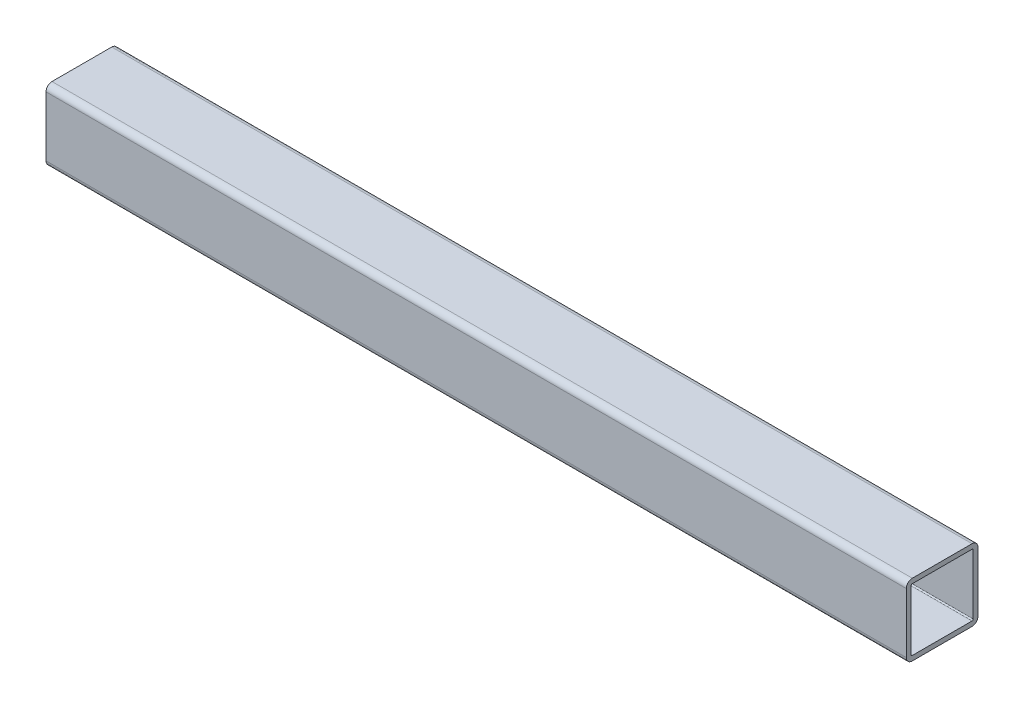
ISO-10303-21;
HEADER;
FILE_DESCRIPTION(('STEP AP214'),'2;1');
FILE_NAME('part.step','',(''),(''),'','','');
FILE_SCHEMA(('AUTOMOTIVE_DESIGN { 1 0 10303 214 1 1 1 1 }'));
ENDSEC;
DATA;
#1=APPLICATION_CONTEXT('core data for automotive mechanical design processes');
#2=APPLICATION_PROTOCOL_DEFINITION('international standard','automotive_design',2000,#1);
#3=PRODUCT_CONTEXT('',#1,'mechanical');
#4=PRODUCT('Part','Part','',(#3));
#5=PRODUCT_RELATED_PRODUCT_CATEGORY('part','',(#4));
#6=PRODUCT_DEFINITION_FORMATION('','',#4);
#7=PRODUCT_DEFINITION_CONTEXT('part definition',#1,'design');
#8=PRODUCT_DEFINITION('design','',#6,#7);
#9=PRODUCT_DEFINITION_SHAPE('','',#8);
#10=(LENGTH_UNIT() NAMED_UNIT(*) SI_UNIT(.MILLI.,.METRE.));
#11=(NAMED_UNIT(*) PLANE_ANGLE_UNIT() SI_UNIT($,.RADIAN.));
#12=(NAMED_UNIT(*) SI_UNIT($,.STERADIAN.) SOLID_ANGLE_UNIT());
#13=UNCERTAINTY_MEASURE_WITH_UNIT(LENGTH_MEASURE(1.E-05),#10,'distance_accuracy_value','');
#14=(GEOMETRIC_REPRESENTATION_CONTEXT(3) GLOBAL_UNCERTAINTY_ASSIGNED_CONTEXT((#13)) GLOBAL_UNIT_ASSIGNED_CONTEXT((#10,
#11,#12)) REPRESENTATION_CONTEXT('',''));
#15=CARTESIAN_POINT('',(0.,0.,0.));
#16=DIRECTION('',(0.,0.,1.));
#17=DIRECTION('',(1.,0.,0.));
#18=AXIS2_PLACEMENT_3D('',#15,#16,#17);
#19=CARTESIAN_POINT('',(228.6,-15.875,15.875));
#20=DIRECTION('',(1.,0.,0.));
#21=DIRECTION('',(0.,0.,-1.));
#22=AXIS2_PLACEMENT_3D('',#19,#20,#21);
#23=PLANE('',#22);
#24=CARTESIAN_POINT('',(228.6,-15.875,15.875));
#25=DIRECTION('',(1.,0.,0.));
#26=DIRECTION('',(0.,0.,-1.));
#27=AXIS2_PLACEMENT_3D('',#24,#25,#26);
#28=CIRCLE('',#27,3.175);
#29=CARTESIAN_POINT('',(228.6,-15.875,19.05));
#30=VERTEX_POINT('',#29);
#31=CARTESIAN_POINT('',(228.6,-19.05,15.875));
#32=VERTEX_POINT('',#31);
#33=EDGE_CURVE('E258',#30,#32,#28,.T.);
#34=ORIENTED_EDGE('',*,*,#33,.T.);
#35=DIRECTION('',(0.,0.,-1.));
#36=VECTOR('',#35,1.);
#37=CARTESIAN_POINT('',(228.6,-19.05,15.875));
#38=LINE('',#37,#36);
#39=CARTESIAN_POINT('',(228.6,-19.05,-15.875));
#40=VERTEX_POINT('',#39);
#41=EDGE_CURVE('E261',#32,#40,#38,.T.);
#42=ORIENTED_EDGE('',*,*,#41,.T.);
#43=CARTESIAN_POINT('',(228.6,-15.875,-15.875));
#44=DIRECTION('',(1.,0.,0.));
#45=DIRECTION('',(0.,0.,-1.));
#46=AXIS2_PLACEMENT_3D('',#43,#44,#45);
#47=CIRCLE('',#46,3.175);
#48=CARTESIAN_POINT('',(228.6,-15.875,-19.05));
#49=VERTEX_POINT('',#48);
#50=EDGE_CURVE('E264',#40,#49,#47,.T.);
#51=ORIENTED_EDGE('',*,*,#50,.T.);
#52=DIRECTION('',(0.,1.,0.));
#53=VECTOR('',#52,1.);
#54=CARTESIAN_POINT('',(228.6,15.875,-19.05));
#55=LINE('',#54,#53);
#56=CARTESIAN_POINT('',(228.6,15.875,-19.05));
#57=VERTEX_POINT('',#56);
#58=EDGE_CURVE('E266',#49,#57,#55,.T.);
#59=ORIENTED_EDGE('',*,*,#58,.T.);
#60=CARTESIAN_POINT('',(228.6,15.875,-15.875));
#61=DIRECTION('',(1.,0.,0.));
#62=DIRECTION('',(0.,0.,-1.));
#63=AXIS2_PLACEMENT_3D('',#60,#61,#62);
#64=CIRCLE('',#63,3.175);
#65=CARTESIAN_POINT('',(228.6,19.05,-15.875));
#66=VERTEX_POINT('',#65);
#67=EDGE_CURVE('E268',#57,#66,#64,.T.);
#68=ORIENTED_EDGE('',*,*,#67,.T.);
#69=DIRECTION('',(0.,0.,1.));
#70=VECTOR('',#69,1.);
#71=CARTESIAN_POINT('',(228.6,19.05,15.875));
#72=LINE('',#71,#70);
#73=CARTESIAN_POINT('',(228.6,19.05,15.875));
#74=VERTEX_POINT('',#73);
#75=EDGE_CURVE('E270',#66,#74,#72,.T.);
#76=ORIENTED_EDGE('',*,*,#75,.T.);
#77=CARTESIAN_POINT('',(228.6,15.875,15.875));
#78=DIRECTION('',(1.,0.,0.));
#79=DIRECTION('',(0.,0.,-1.));
#80=AXIS2_PLACEMENT_3D('',#77,#78,#79);
#81=CIRCLE('',#80,3.175);
#82=CARTESIAN_POINT('',(228.6,15.875,19.05));
#83=VERTEX_POINT('',#82);
#84=EDGE_CURVE('E272',#74,#83,#81,.T.);
#85=ORIENTED_EDGE('',*,*,#84,.T.);
#86=DIRECTION('',(0.,-1.,0.));
#87=VECTOR('',#86,1.);
#88=CARTESIAN_POINT('',(228.6,15.875,19.05));
#89=LINE('',#88,#87);
#90=EDGE_CURVE('E274',#83,#30,#89,.T.);
#91=ORIENTED_EDGE('',*,*,#90,.T.);
#92=EDGE_LOOP('',(#34,#42,#51,#59,#68,#76,#85,#91));
#93=FACE_BOUND('',#92,.T.);
#94=DIRECTION('',(0.,0.,-1.));
#95=VECTOR('',#94,1.);
#96=CARTESIAN_POINT('',(228.6,-16.51,15.875));
#97=LINE('',#96,#95);
#98=CARTESIAN_POINT('',(228.6,-16.51,15.875));
#99=VERTEX_POINT('',#98);
#100=CARTESIAN_POINT('',(228.6,-16.51,-15.875));
#101=VERTEX_POINT('',#100);
#102=EDGE_CURVE('E201',#99,#101,#97,.T.);
#103=ORIENTED_EDGE('',*,*,#102,.F.);
#104=CARTESIAN_POINT('',(228.6,-15.875,15.875));
#105=DIRECTION('',(1.,0.,0.));
#106=DIRECTION('',(0.,0.,-1.));
#107=AXIS2_PLACEMENT_3D('',#104,#105,#106);
#108=CIRCLE('',#107,0.635000000000002);
#109=CARTESIAN_POINT('',(228.6,-15.875,16.51));
#110=VERTEX_POINT('',#109);
#111=EDGE_CURVE('E193',#110,#99,#108,.T.);
#112=ORIENTED_EDGE('',*,*,#111,.F.);
#113=DIRECTION('',(0.,-1.,0.));
#114=VECTOR('',#113,1.);
#115=CARTESIAN_POINT('',(228.6,15.875,16.51));
#116=LINE('',#115,#114);
#117=CARTESIAN_POINT('',(228.6,15.875,16.51));
#118=VERTEX_POINT('',#117);
#119=EDGE_CURVE('E226',#118,#110,#116,.T.);
#120=ORIENTED_EDGE('',*,*,#119,.F.);
#121=CARTESIAN_POINT('',(228.6,15.875,15.875));
#122=DIRECTION('',(1.,0.,0.));
#123=DIRECTION('',(0.,0.,-1.));
#124=AXIS2_PLACEMENT_3D('',#121,#122,#123);
#125=CIRCLE('',#124,0.635000000000004);
#126=CARTESIAN_POINT('',(228.6,16.51,15.875));
#127=VERTEX_POINT('',#126);
#128=EDGE_CURVE('E224',#127,#118,#125,.T.);
#129=ORIENTED_EDGE('',*,*,#128,.F.);
#130=DIRECTION('',(0.,0.,1.));
#131=VECTOR('',#130,1.);
#132=CARTESIAN_POINT('',(228.6,16.51,15.875));
#133=LINE('',#132,#131);
#134=CARTESIAN_POINT('',(228.6,16.51,-15.875));
#135=VERTEX_POINT('',#134);
#136=EDGE_CURVE('E222',#135,#127,#133,.T.);
#137=ORIENTED_EDGE('',*,*,#136,.F.);
#138=CARTESIAN_POINT('',(228.6,15.875,-15.875));
#139=DIRECTION('',(1.,0.,0.));
#140=DIRECTION('',(0.,0.,-1.));
#141=AXIS2_PLACEMENT_3D('',#138,#139,#140);
#142=CIRCLE('',#141,0.635000000000004);
#143=CARTESIAN_POINT('',(228.6,15.875,-16.51));
#144=VERTEX_POINT('',#143);
#145=EDGE_CURVE('E220',#144,#135,#142,.T.);
#146=ORIENTED_EDGE('',*,*,#145,.F.);
#147=DIRECTION('',(0.,1.,0.));
#148=VECTOR('',#147,1.);
#149=CARTESIAN_POINT('',(228.6,15.875,-16.51));
#150=LINE('',#149,#148);
#151=CARTESIAN_POINT('',(228.6,-15.875,-16.51));
#152=VERTEX_POINT('',#151);
#153=EDGE_CURVE('E216',#152,#144,#150,.T.);
#154=ORIENTED_EDGE('',*,*,#153,.F.);
#155=CARTESIAN_POINT('',(228.6,-15.875,-15.875));
#156=DIRECTION('',(1.,0.,0.));
#157=DIRECTION('',(0.,0.,-1.));
#158=AXIS2_PLACEMENT_3D('',#155,#156,#157);
#159=CIRCLE('',#158,0.634999999999999);
#160=EDGE_CURVE('E214',#101,#152,#159,.T.);
#161=ORIENTED_EDGE('',*,*,#160,.F.);
#162=EDGE_LOOP('',(#103,#112,#120,#129,#137,#146,#154,#161));
#163=FACE_BOUND('',#162,.T.);
#164=ADVANCED_FACE('F80',(#93,#163),#23,.T.);
#165=CARTESIAN_POINT('',(-228.6,-15.875,15.875));
#166=DIRECTION('',(1.,0.,0.));
#167=DIRECTION('',(0.,0.,-1.));
#168=AXIS2_PLACEMENT_3D('',#165,#166,#167);
#169=PLANE('',#168);
#170=CARTESIAN_POINT('',(-228.6,-15.875,15.875));
#171=DIRECTION('',(1.,0.,0.));
#172=DIRECTION('',(0.,0.,-1.));
#173=AXIS2_PLACEMENT_3D('',#170,#171,#172);
#174=CIRCLE('',#173,3.175);
#175=CARTESIAN_POINT('',(-228.6,-15.875,19.05));
#176=VERTEX_POINT('',#175);
#177=CARTESIAN_POINT('',(-228.6,-19.05,15.875));
#178=VERTEX_POINT('',#177);
#179=EDGE_CURVE('E209',#176,#178,#174,.T.);
#180=ORIENTED_EDGE('',*,*,#179,.F.);
#181=DIRECTION('',(0.,-1.,0.));
#182=VECTOR('',#181,1.);
#183=CARTESIAN_POINT('',(-228.6,15.875,19.05));
#184=LINE('',#183,#182);
#185=CARTESIAN_POINT('',(-228.6,15.875,19.05));
#186=VERTEX_POINT('',#185);
#187=EDGE_CURVE('E262',#186,#176,#184,.T.);
#188=ORIENTED_EDGE('',*,*,#187,.F.);
#189=CARTESIAN_POINT('',(-228.6,15.875,15.875));
#190=DIRECTION('',(1.,0.,0.));
#191=DIRECTION('',(0.,0.,-1.));
#192=AXIS2_PLACEMENT_3D('',#189,#190,#191);
#193=CIRCLE('',#192,3.175);
#194=CARTESIAN_POINT('',(-228.6,19.05,15.875));
#195=VERTEX_POINT('',#194);
#196=EDGE_CURVE('E289',#195,#186,#193,.T.);
#197=ORIENTED_EDGE('',*,*,#196,.F.);
#198=DIRECTION('',(0.,0.,1.));
#199=VECTOR('',#198,1.);
#200=CARTESIAN_POINT('',(-228.6,19.05,15.875));
#201=LINE('',#200,#199);
#202=CARTESIAN_POINT('',(-228.6,19.05,-15.875));
#203=VERTEX_POINT('',#202);
#204=EDGE_CURVE('E287',#203,#195,#201,.T.);
#205=ORIENTED_EDGE('',*,*,#204,.F.);
#206=CARTESIAN_POINT('',(-228.6,15.875,-15.875));
#207=DIRECTION('',(1.,0.,0.));
#208=DIRECTION('',(0.,0.,-1.));
#209=AXIS2_PLACEMENT_3D('',#206,#207,#208);
#210=CIRCLE('',#209,3.175);
#211=CARTESIAN_POINT('',(-228.6,15.875,-19.05));
#212=VERTEX_POINT('',#211);
#213=EDGE_CURVE('E285',#212,#203,#210,.T.);
#214=ORIENTED_EDGE('',*,*,#213,.F.);
#215=DIRECTION('',(0.,1.,0.));
#216=VECTOR('',#215,1.);
#217=CARTESIAN_POINT('',(-228.6,15.875,-19.05));
#218=LINE('',#217,#216);
#219=CARTESIAN_POINT('',(-228.6,-15.875,-19.05));
#220=VERTEX_POINT('',#219);
#221=EDGE_CURVE('E283',#220,#212,#218,.T.);
#222=ORIENTED_EDGE('',*,*,#221,.F.);
#223=CARTESIAN_POINT('',(-228.6,-15.875,-15.875));
#224=DIRECTION('',(1.,0.,0.));
#225=DIRECTION('',(0.,0.,-1.));
#226=AXIS2_PLACEMENT_3D('',#223,#224,#225);
#227=CIRCLE('',#226,3.175);
#228=CARTESIAN_POINT('',(-228.6,-19.05,-15.875));
#229=VERTEX_POINT('',#228);
#230=EDGE_CURVE('E281',#229,#220,#227,.T.);
#231=ORIENTED_EDGE('',*,*,#230,.F.);
#232=DIRECTION('',(0.,0.,-1.));
#233=VECTOR('',#232,1.);
#234=CARTESIAN_POINT('',(-228.6,-19.05,15.875));
#235=LINE('',#234,#233);
#236=EDGE_CURVE('E279',#178,#229,#235,.T.);
#237=ORIENTED_EDGE('',*,*,#236,.F.);
#238=EDGE_LOOP('',(#180,#188,#197,#205,#214,#222,#231,#237));
#239=FACE_BOUND('',#238,.T.);
#240=CARTESIAN_POINT('',(-228.6,-15.875,15.875));
#241=DIRECTION('',(1.,0.,0.));
#242=DIRECTION('',(0.,0.,-1.));
#243=AXIS2_PLACEMENT_3D('',#240,#241,#242);
#244=CIRCLE('',#243,0.635000000000002);
#245=CARTESIAN_POINT('',(-228.6,-15.875,16.51));
#246=VERTEX_POINT('',#245);
#247=CARTESIAN_POINT('',(-228.6,-16.51,15.875));
#248=VERTEX_POINT('',#247);
#249=EDGE_CURVE('E103',#246,#248,#244,.T.);
#250=ORIENTED_EDGE('',*,*,#249,.T.);
#251=DIRECTION('',(0.,0.,-1.));
#252=VECTOR('',#251,1.);
#253=CARTESIAN_POINT('',(-228.6,-16.51,15.875));
#254=LINE('',#253,#252);
#255=CARTESIAN_POINT('',(-228.6,-16.51,-15.875));
#256=VERTEX_POINT('',#255);
#257=EDGE_CURVE('E208',#248,#256,#254,.T.);
#258=ORIENTED_EDGE('',*,*,#257,.T.);
#259=CARTESIAN_POINT('',(-228.6,-15.875,-15.875));
#260=DIRECTION('',(1.,0.,0.));
#261=DIRECTION('',(0.,0.,-1.));
#262=AXIS2_PLACEMENT_3D('',#259,#260,#261);
#263=CIRCLE('',#262,0.634999999999999);
#264=CARTESIAN_POINT('',(-228.6,-15.875,-16.51));
#265=VERTEX_POINT('',#264);
#266=EDGE_CURVE('E230',#256,#265,#263,.T.);
#267=ORIENTED_EDGE('',*,*,#266,.T.);
#268=DIRECTION('',(0.,1.,0.));
#269=VECTOR('',#268,1.);
#270=CARTESIAN_POINT('',(-228.6,15.875,-16.51));
#271=LINE('',#270,#269);
#272=CARTESIAN_POINT('',(-228.6,15.875,-16.51));
#273=VERTEX_POINT('',#272);
#274=EDGE_CURVE('E233',#265,#273,#271,.T.);
#275=ORIENTED_EDGE('',*,*,#274,.T.);
#276=CARTESIAN_POINT('',(-228.6,15.875,-15.875));
#277=DIRECTION('',(1.,0.,0.));
#278=DIRECTION('',(0.,0.,-1.));
#279=AXIS2_PLACEMENT_3D('',#276,#277,#278);
#280=CIRCLE('',#279,0.635000000000004);
#281=CARTESIAN_POINT('',(-228.6,16.51,-15.875));
#282=VERTEX_POINT('',#281);
#283=EDGE_CURVE('E236',#273,#282,#280,.T.);
#284=ORIENTED_EDGE('',*,*,#283,.T.);
#285=DIRECTION('',(0.,0.,1.));
#286=VECTOR('',#285,1.);
#287=CARTESIAN_POINT('',(-228.6,16.51,15.875));
#288=LINE('',#287,#286);
#289=CARTESIAN_POINT('',(-228.6,16.51,15.875));
#290=VERTEX_POINT('',#289);
#291=EDGE_CURVE('E239',#282,#290,#288,.T.);
#292=ORIENTED_EDGE('',*,*,#291,.T.);
#293=CARTESIAN_POINT('',(-228.6,15.875,15.875));
#294=DIRECTION('',(1.,0.,0.));
#295=DIRECTION('',(0.,0.,-1.));
#296=AXIS2_PLACEMENT_3D('',#293,#294,#295);
#297=CIRCLE('',#296,0.635000000000004);
#298=CARTESIAN_POINT('',(-228.6,15.875,16.51));
#299=VERTEX_POINT('',#298);
#300=EDGE_CURVE('E242',#290,#299,#297,.T.);
#301=ORIENTED_EDGE('',*,*,#300,.T.);
#302=DIRECTION('',(0.,-1.,0.));
#303=VECTOR('',#302,1.);
#304=CARTESIAN_POINT('',(-228.6,15.875,16.51));
#305=LINE('',#304,#303);
#306=EDGE_CURVE('E202',#299,#246,#305,.T.);
#307=ORIENTED_EDGE('',*,*,#306,.T.);
#308=EDGE_LOOP('',(#250,#258,#267,#275,#284,#292,#301,#307));
#309=FACE_BOUND('',#308,.T.);
#310=ADVANCED_FACE('F319',(#239,#309),#169,.F.);
#311=CARTESIAN_POINT('',(228.6,-15.875,15.875));
#312=DIRECTION('',(-1.,0.,0.));
#313=DIRECTION('',(0.,0.,1.));
#314=AXIS2_PLACEMENT_3D('',#311,#312,#313);
#315=CYLINDRICAL_SURFACE('',#314,3.175);
#316=ORIENTED_EDGE('',*,*,#179,.T.);
#317=DIRECTION('',(-1.,0.,0.));
#318=VECTOR('',#317,1.);
#319=CARTESIAN_POINT('',(228.6,-19.05,15.875));
#320=LINE('',#319,#318);
#321=EDGE_CURVE('E12',#32,#178,#320,.T.);
#322=ORIENTED_EDGE('',*,*,#321,.F.);
#323=ORIENTED_EDGE('',*,*,#33,.F.);
#324=DIRECTION('',(-1.,0.,0.));
#325=VECTOR('',#324,1.);
#326=CARTESIAN_POINT('',(228.6,-15.875,19.05));
#327=LINE('',#326,#325);
#328=EDGE_CURVE('E276',#30,#176,#327,.T.);
#329=ORIENTED_EDGE('',*,*,#328,.T.);
#330=EDGE_LOOP('',(#316,#322,#323,#329));
#331=FACE_BOUND('',#330,.T.);
#332=ADVANCED_FACE('F82',(#331),#315,.T.);
#333=CARTESIAN_POINT('',(228.6,-19.05,15.875));
#334=DIRECTION('',(0.,1.,0.));
#335=DIRECTION('',(0.,0.,1.));
#336=AXIS2_PLACEMENT_3D('',#333,#334,#335);
#337=PLANE('',#336);
#338=ORIENTED_EDGE('',*,*,#236,.T.);
#339=DIRECTION('',(-1.,0.,0.));
#340=VECTOR('',#339,1.);
#341=CARTESIAN_POINT('',(228.6,-19.05,-15.875));
#342=LINE('',#341,#340);
#343=EDGE_CURVE('E88',#40,#229,#342,.T.);
#344=ORIENTED_EDGE('',*,*,#343,.F.);
#345=ORIENTED_EDGE('',*,*,#41,.F.);
#346=ORIENTED_EDGE('',*,*,#321,.T.);
#347=EDGE_LOOP('',(#338,#344,#345,#346));
#348=FACE_BOUND('',#347,.T.);
#349=ADVANCED_FACE('F336',(#348),#337,.F.);
#350=CARTESIAN_POINT('',(228.6,-15.875,-15.875));
#351=DIRECTION('',(-1.,0.,0.));
#352=DIRECTION('',(0.,0.,1.));
#353=AXIS2_PLACEMENT_3D('',#350,#351,#352);
#354=CYLINDRICAL_SURFACE('',#353,3.175);
#355=ORIENTED_EDGE('',*,*,#230,.T.);
#356=DIRECTION('',(-1.,0.,0.));
#357=VECTOR('',#356,1.);
#358=CARTESIAN_POINT('',(228.6,-15.875,-19.05));
#359=LINE('',#358,#357);
#360=EDGE_CURVE('E306',#49,#220,#359,.T.);
#361=ORIENTED_EDGE('',*,*,#360,.F.);
#362=ORIENTED_EDGE('',*,*,#50,.F.);
#363=ORIENTED_EDGE('',*,*,#343,.T.);
#364=EDGE_LOOP('',(#355,#361,#362,#363));
#365=FACE_BOUND('',#364,.T.);
#366=ADVANCED_FACE('F313',(#365),#354,.T.);
#367=CARTESIAN_POINT('',(228.6,15.875,-19.05));
#368=DIRECTION('',(0.,0.,1.));
#369=DIRECTION('',(0.,-1.,0.));
#370=AXIS2_PLACEMENT_3D('',#367,#368,#369);
#371=PLANE('',#370);
#372=ORIENTED_EDGE('',*,*,#221,.T.);
#373=DIRECTION('',(-1.,0.,0.));
#374=VECTOR('',#373,1.);
#375=CARTESIAN_POINT('',(228.6,15.875,-19.05));
#376=LINE('',#375,#374);
#377=EDGE_CURVE('E303',#57,#212,#376,.T.);
#378=ORIENTED_EDGE('',*,*,#377,.F.);
#379=ORIENTED_EDGE('',*,*,#58,.F.);
#380=ORIENTED_EDGE('',*,*,#360,.T.);
#381=EDGE_LOOP('',(#372,#378,#379,#380));
#382=FACE_BOUND('',#381,.T.);
#383=ADVANCED_FACE('F325',(#382),#371,.F.);
#384=CARTESIAN_POINT('',(228.6,15.875,-15.875));
#385=DIRECTION('',(-1.,0.,0.));
#386=DIRECTION('',(0.,0.,1.));
#387=AXIS2_PLACEMENT_3D('',#384,#385,#386);
#388=CYLINDRICAL_SURFACE('',#387,3.175);
#389=ORIENTED_EDGE('',*,*,#213,.T.);
#390=DIRECTION('',(-1.,0.,0.));
#391=VECTOR('',#390,1.);
#392=CARTESIAN_POINT('',(228.6,19.05,-15.875));
#393=LINE('',#392,#391);
#394=EDGE_CURVE('E300',#66,#203,#393,.T.);
#395=ORIENTED_EDGE('',*,*,#394,.F.);
#396=ORIENTED_EDGE('',*,*,#67,.F.);
#397=ORIENTED_EDGE('',*,*,#377,.T.);
#398=EDGE_LOOP('',(#389,#395,#396,#397));
#399=FACE_BOUND('',#398,.T.);
#400=ADVANCED_FACE('F329',(#399),#388,.T.);
#401=CARTESIAN_POINT('',(228.6,19.05,15.875));
#402=DIRECTION('',(0.,-1.,0.));
#403=DIRECTION('',(0.,0.,-1.));
#404=AXIS2_PLACEMENT_3D('',#401,#402,#403);
#405=PLANE('',#404);
#406=ORIENTED_EDGE('',*,*,#204,.T.);
#407=DIRECTION('',(-1.,0.,0.));
#408=VECTOR('',#407,1.);
#409=CARTESIAN_POINT('',(228.6,19.05,15.875));
#410=LINE('',#409,#408);
#411=EDGE_CURVE('E297',#74,#195,#410,.T.);
#412=ORIENTED_EDGE('',*,*,#411,.F.);
#413=ORIENTED_EDGE('',*,*,#75,.F.);
#414=ORIENTED_EDGE('',*,*,#394,.T.);
#415=EDGE_LOOP('',(#406,#412,#413,#414));
#416=FACE_BOUND('',#415,.T.);
#417=ADVANCED_FACE('F349',(#416),#405,.F.);
#418=CARTESIAN_POINT('',(228.6,15.875,15.875));
#419=DIRECTION('',(-1.,0.,0.));
#420=DIRECTION('',(0.,0.,1.));
#421=AXIS2_PLACEMENT_3D('',#418,#419,#420);
#422=CYLINDRICAL_SURFACE('',#421,3.175);
#423=ORIENTED_EDGE('',*,*,#196,.T.);
#424=DIRECTION('',(-1.,0.,0.));
#425=VECTOR('',#424,1.);
#426=CARTESIAN_POINT('',(228.6,15.875,19.05));
#427=LINE('',#426,#425);
#428=EDGE_CURVE('E294',#83,#186,#427,.T.);
#429=ORIENTED_EDGE('',*,*,#428,.F.);
#430=ORIENTED_EDGE('',*,*,#84,.F.);
#431=ORIENTED_EDGE('',*,*,#411,.T.);
#432=EDGE_LOOP('',(#423,#429,#430,#431));
#433=FACE_BOUND('',#432,.T.);
#434=ADVANCED_FACE('F347',(#433),#422,.T.);
#435=CARTESIAN_POINT('',(228.6,15.875,19.05));
#436=DIRECTION('',(0.,0.,-1.));
#437=DIRECTION('',(0.,1.,0.));
#438=AXIS2_PLACEMENT_3D('',#435,#436,#437);
#439=PLANE('',#438);
#440=ORIENTED_EDGE('',*,*,#187,.T.);
#441=ORIENTED_EDGE('',*,*,#328,.F.);
#442=ORIENTED_EDGE('',*,*,#90,.F.);
#443=ORIENTED_EDGE('',*,*,#428,.T.);
#444=EDGE_LOOP('',(#440,#441,#442,#443));
#445=FACE_BOUND('',#444,.T.);
#446=ADVANCED_FACE('F342',(#445),#439,.F.);
#447=CARTESIAN_POINT('',(228.6,-15.875,15.875));
#448=DIRECTION('',(-1.,0.,0.));
#449=DIRECTION('',(0.,0.,1.));
#450=AXIS2_PLACEMENT_3D('',#447,#448,#449);
#451=CYLINDRICAL_SURFACE('',#450,0.635000000000002);
#452=ORIENTED_EDGE('',*,*,#249,.F.);
#453=DIRECTION('',(-1.,0.,0.));
#454=VECTOR('',#453,1.);
#455=CARTESIAN_POINT('',(228.6,-15.875,16.51));
#456=LINE('',#455,#454);
#457=EDGE_CURVE('E197',#110,#246,#456,.T.);
#458=ORIENTED_EDGE('',*,*,#457,.F.);
#459=ORIENTED_EDGE('',*,*,#111,.T.);
#460=DIRECTION('',(-1.,0.,0.));
#461=VECTOR('',#460,1.);
#462=CARTESIAN_POINT('',(228.6,-16.51,15.875));
#463=LINE('',#462,#461);
#464=EDGE_CURVE('E196',#99,#248,#463,.T.);
#465=ORIENTED_EDGE('',*,*,#464,.T.);
#466=EDGE_LOOP('',(#452,#458,#459,#465));
#467=FACE_BOUND('',#466,.T.);
#468=ADVANCED_FACE('F195',(#467),#451,.F.);
#469=CARTESIAN_POINT('',(228.6,-16.51,15.875));
#470=DIRECTION('',(0.,1.,0.));
#471=DIRECTION('',(0.,0.,1.));
#472=AXIS2_PLACEMENT_3D('',#469,#470,#471);
#473=PLANE('',#472);
#474=ORIENTED_EDGE('',*,*,#257,.F.);
#475=ORIENTED_EDGE('',*,*,#464,.F.);
#476=ORIENTED_EDGE('',*,*,#102,.T.);
#477=DIRECTION('',(-1.,0.,0.));
#478=VECTOR('',#477,1.);
#479=CARTESIAN_POINT('',(228.6,-16.51,-15.875));
#480=LINE('',#479,#478);
#481=EDGE_CURVE('E210',#101,#256,#480,.T.);
#482=ORIENTED_EDGE('',*,*,#481,.T.);
#483=EDGE_LOOP('',(#474,#475,#476,#482));
#484=FACE_BOUND('',#483,.T.);
#485=ADVANCED_FACE('F205',(#484),#473,.T.);
#486=CARTESIAN_POINT('',(228.6,-15.875,-15.875));
#487=DIRECTION('',(-1.,0.,0.));
#488=DIRECTION('',(0.,0.,1.));
#489=AXIS2_PLACEMENT_3D('',#486,#487,#488);
#490=CYLINDRICAL_SURFACE('',#489,0.634999999999999);
#491=ORIENTED_EDGE('',*,*,#266,.F.);
#492=ORIENTED_EDGE('',*,*,#481,.F.);
#493=ORIENTED_EDGE('',*,*,#160,.T.);
#494=DIRECTION('',(-1.,0.,0.));
#495=VECTOR('',#494,1.);
#496=CARTESIAN_POINT('',(228.6,-15.875,-16.51));
#497=LINE('',#496,#495);
#498=EDGE_CURVE('E255',#152,#265,#497,.T.);
#499=ORIENTED_EDGE('',*,*,#498,.T.);
#500=EDGE_LOOP('',(#491,#492,#493,#499));
#501=FACE_BOUND('',#500,.T.);
#502=ADVANCED_FACE('F374',(#501),#490,.F.);
#503=CARTESIAN_POINT('',(228.6,15.875,-16.51));
#504=DIRECTION('',(0.,0.,1.));
#505=DIRECTION('',(0.,-1.,0.));
#506=AXIS2_PLACEMENT_3D('',#503,#504,#505);
#507=PLANE('',#506);
#508=ORIENTED_EDGE('',*,*,#274,.F.);
#509=ORIENTED_EDGE('',*,*,#498,.F.);
#510=ORIENTED_EDGE('',*,*,#153,.T.);
#511=DIRECTION('',(-1.,0.,0.));
#512=VECTOR('',#511,1.);
#513=CARTESIAN_POINT('',(228.6,15.875,-16.51));
#514=LINE('',#513,#512);
#515=EDGE_CURVE('E253',#144,#273,#514,.T.);
#516=ORIENTED_EDGE('',*,*,#515,.T.);
#517=EDGE_LOOP('',(#508,#509,#510,#516));
#518=FACE_BOUND('',#517,.T.);
#519=ADVANCED_FACE('F378',(#518),#507,.T.);
#520=CARTESIAN_POINT('',(228.6,15.875,-15.875));
#521=DIRECTION('',(-1.,0.,0.));
#522=DIRECTION('',(0.,0.,1.));
#523=AXIS2_PLACEMENT_3D('',#520,#521,#522);
#524=CYLINDRICAL_SURFACE('',#523,0.635000000000004);
#525=ORIENTED_EDGE('',*,*,#283,.F.);
#526=ORIENTED_EDGE('',*,*,#515,.F.);
#527=ORIENTED_EDGE('',*,*,#145,.T.);
#528=DIRECTION('',(-1.,0.,0.));
#529=VECTOR('',#528,1.);
#530=CARTESIAN_POINT('',(228.6,16.51,-15.875));
#531=LINE('',#530,#529);
#532=EDGE_CURVE('E251',#135,#282,#531,.T.);
#533=ORIENTED_EDGE('',*,*,#532,.T.);
#534=EDGE_LOOP('',(#525,#526,#527,#533));
#535=FACE_BOUND('',#534,.T.);
#536=ADVANCED_FACE('F384',(#535),#524,.F.);
#537=CARTESIAN_POINT('',(228.6,16.51,15.875));
#538=DIRECTION('',(0.,-1.,0.));
#539=DIRECTION('',(0.,0.,-1.));
#540=AXIS2_PLACEMENT_3D('',#537,#538,#539);
#541=PLANE('',#540);
#542=ORIENTED_EDGE('',*,*,#291,.F.);
#543=ORIENTED_EDGE('',*,*,#532,.F.);
#544=ORIENTED_EDGE('',*,*,#136,.T.);
#545=DIRECTION('',(-1.,0.,0.));
#546=VECTOR('',#545,1.);
#547=CARTESIAN_POINT('',(228.6,16.51,15.875));
#548=LINE('',#547,#546);
#549=EDGE_CURVE('E249',#127,#290,#548,.T.);
#550=ORIENTED_EDGE('',*,*,#549,.T.);
#551=EDGE_LOOP('',(#542,#543,#544,#550));
#552=FACE_BOUND('',#551,.T.);
#553=ADVANCED_FACE('F388',(#552),#541,.T.);
#554=CARTESIAN_POINT('',(228.6,15.875,15.875));
#555=DIRECTION('',(-1.,0.,0.));
#556=DIRECTION('',(0.,0.,1.));
#557=AXIS2_PLACEMENT_3D('',#554,#555,#556);
#558=CYLINDRICAL_SURFACE('',#557,0.635000000000004);
#559=ORIENTED_EDGE('',*,*,#300,.F.);
#560=ORIENTED_EDGE('',*,*,#549,.F.);
#561=ORIENTED_EDGE('',*,*,#128,.T.);
#562=DIRECTION('',(-1.,0.,0.));
#563=VECTOR('',#562,1.);
#564=CARTESIAN_POINT('',(228.6,15.875,16.51));
#565=LINE('',#564,#563);
#566=EDGE_CURVE('E95',#118,#299,#565,.T.);
#567=ORIENTED_EDGE('',*,*,#566,.T.);
#568=EDGE_LOOP('',(#559,#560,#561,#567));
#569=FACE_BOUND('',#568,.T.);
#570=ADVANCED_FACE('F392',(#569),#558,.F.);
#571=CARTESIAN_POINT('',(228.6,15.875,16.51));
#572=DIRECTION('',(0.,0.,-1.));
#573=DIRECTION('',(0.,1.,0.));
#574=AXIS2_PLACEMENT_3D('',#571,#572,#573);
#575=PLANE('',#574);
#576=ORIENTED_EDGE('',*,*,#306,.F.);
#577=ORIENTED_EDGE('',*,*,#566,.F.);
#578=ORIENTED_EDGE('',*,*,#119,.T.);
#579=ORIENTED_EDGE('',*,*,#457,.T.);
#580=EDGE_LOOP('',(#576,#577,#578,#579));
#581=FACE_BOUND('',#580,.T.);
#582=ADVANCED_FACE('F396',(#581),#575,.T.);
#583=CLOSED_SHELL('',(#164,#310,#332,#349,#366,#383,#400,#417,#434,#446,#468,#485,#502,#519,
#536,#553,#570,#582));
#584=MANIFOLD_SOLID_BREP('B2',#583);
#585=ADVANCED_BREP_SHAPE_REPRESENTATION('',(#18,#584),#14);
#586=SHAPE_DEFINITION_REPRESENTATION(#9,#585);
ENDSEC;
END-ISO-10303-21;
